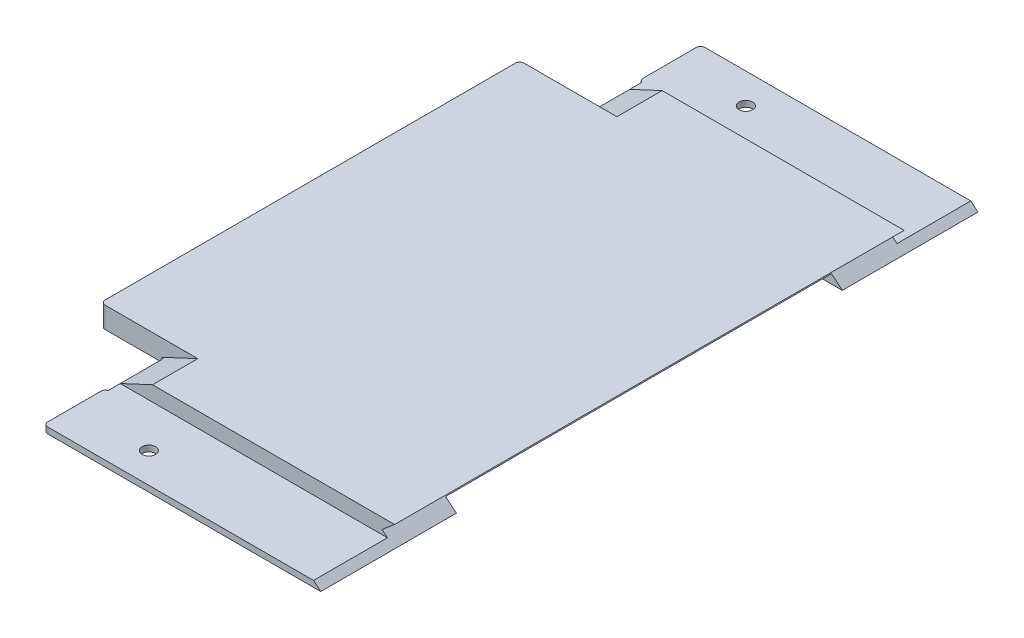
ISO-10303-21;
HEADER;
FILE_DESCRIPTION(('STEP AP214'),'2;1');
FILE_NAME('part.step','',(''),(''),'','','');
FILE_SCHEMA(('AUTOMOTIVE_DESIGN { 1 0 10303 214 1 1 1 1 }'));
ENDSEC;
DATA;
#1=APPLICATION_CONTEXT('core data for automotive mechanical design processes');
#2=APPLICATION_PROTOCOL_DEFINITION('international standard','automotive_design',2000,#1);
#3=PRODUCT_CONTEXT('',#1,'mechanical');
#4=PRODUCT('Part','Part','',(#3));
#5=PRODUCT_RELATED_PRODUCT_CATEGORY('part','',(#4));
#6=PRODUCT_DEFINITION_FORMATION('','',#4);
#7=PRODUCT_DEFINITION_CONTEXT('part definition',#1,'design');
#8=PRODUCT_DEFINITION('design','',#6,#7);
#9=PRODUCT_DEFINITION_SHAPE('','',#8);
#10=(LENGTH_UNIT() NAMED_UNIT(*) SI_UNIT(.MILLI.,.METRE.));
#11=(NAMED_UNIT(*) PLANE_ANGLE_UNIT() SI_UNIT($,.RADIAN.));
#12=(NAMED_UNIT(*) SI_UNIT($,.STERADIAN.) SOLID_ANGLE_UNIT());
#13=UNCERTAINTY_MEASURE_WITH_UNIT(LENGTH_MEASURE(1.E-05),#10,'distance_accuracy_value','');
#14=(GEOMETRIC_REPRESENTATION_CONTEXT(3) GLOBAL_UNCERTAINTY_ASSIGNED_CONTEXT((#13)) GLOBAL_UNIT_ASSIGNED_CONTEXT((#10,
#11,#12)) REPRESENTATION_CONTEXT('',''));
#15=CARTESIAN_POINT('',(0.,0.,0.));
#16=DIRECTION('',(0.,0.,1.));
#17=DIRECTION('',(1.,0.,0.));
#18=AXIS2_PLACEMENT_3D('',#15,#16,#17);
#19=CARTESIAN_POINT('',(0.,0.,0.));
#20=DIRECTION('',(0.,1.,0.));
#21=DIRECTION('',(0.,0.,1.));
#22=AXIS2_PLACEMENT_3D('',#19,#20,#21);
#23=PLANE('',#22);
#24=CARTESIAN_POINT('',(-67.,0.,-99.));
#25=DIRECTION('',(0.,-1.,0.));
#26=DIRECTION('',(0.,0.,-1.));
#27=AXIS2_PLACEMENT_3D('',#24,#25,#26);
#28=CIRCLE('',#27,2.25);
#29=CARTESIAN_POINT('',(-67.,0.,-101.25));
#30=VERTEX_POINT('',#29);
#31=EDGE_CURVE('E412',#30,#30,#28,.T.);
#32=ORIENTED_EDGE('',*,*,#31,.F.);
#33=EDGE_LOOP('',(#32));
#34=FACE_BOUND('',#33,.T.);
#35=DIRECTION('',(-1.,0.,0.));
#36=VECTOR('',#35,1.);
#37=CARTESIAN_POINT('',(0.,0.,-109.));
#38=LINE('',#37,#36);
#39=CARTESIAN_POINT('',(0.,0.,-109.));
#40=VERTEX_POINT('',#39);
#41=CARTESIAN_POINT('',(-90.5,0.,-109.));
#42=VERTEX_POINT('',#41);
#43=EDGE_CURVE('E462',#40,#42,#38,.T.);
#44=ORIENTED_EDGE('',*,*,#43,.F.);
#45=DIRECTION('',(0.,0.,-1.));
#46=VECTOR('',#45,1.);
#47=CARTESIAN_POINT('',(0.,0.,109.));
#48=LINE('',#47,#46);
#49=CARTESIAN_POINT('',(0.,0.,-64.));
#50=VERTEX_POINT('',#49);
#51=EDGE_CURVE('E297',#50,#40,#48,.T.);
#52=ORIENTED_EDGE('',*,*,#51,.F.);
#53=DIRECTION('',(1.,0.,0.));
#54=VECTOR('',#53,1.);
#55=CARTESIAN_POINT('',(0.,0.,-64.));
#56=LINE('',#55,#54);
#57=CARTESIAN_POINT('',(-41.875,0.,-64.));
#58=VERTEX_POINT('',#57);
#59=EDGE_CURVE('E489',#58,#50,#56,.T.);
#60=ORIENTED_EDGE('',*,*,#59,.F.);
#61=CARTESIAN_POINT('',(-41.875,0.,-63.));
#62=DIRECTION('',(0.,1.,0.));
#63=DIRECTION('',(0.,0.,1.));
#64=AXIS2_PLACEMENT_3D('',#61,#62,#63);
#65=CIRCLE('',#64,1.);
#66=CARTESIAN_POINT('',(-42.875,0.,-63.));
#67=VERTEX_POINT('',#66);
#68=EDGE_CURVE('E504',#58,#67,#65,.T.);
#69=ORIENTED_EDGE('',*,*,#68,.T.);
#70=DIRECTION('',(0.,0.,1.));
#71=VECTOR('',#70,1.);
#72=CARTESIAN_POINT('',(-42.875,0.,64.));
#73=LINE('',#72,#71);
#74=CARTESIAN_POINT('',(-42.875,0.,63.));
#75=VERTEX_POINT('',#74);
#76=EDGE_CURVE('E420',#67,#75,#73,.T.);
#77=ORIENTED_EDGE('',*,*,#76,.T.);
#78=CARTESIAN_POINT('',(-41.875,0.,63.));
#79=DIRECTION('',(0.,-1.,0.));
#80=DIRECTION('',(0.,0.,-1.));
#81=AXIS2_PLACEMENT_3D('',#78,#79,#80);
#82=CIRCLE('',#81,1.);
#83=CARTESIAN_POINT('',(-41.875,0.,64.));
#84=VERTEX_POINT('',#83);
#85=EDGE_CURVE('E358',#84,#75,#82,.T.);
#86=ORIENTED_EDGE('',*,*,#85,.F.);
#87=DIRECTION('',(1.,0.,0.));
#88=VECTOR('',#87,1.);
#89=CARTESIAN_POINT('',(0.,0.,64.));
#90=LINE('',#89,#88);
#91=CARTESIAN_POINT('',(0.,0.,64.));
#92=VERTEX_POINT('',#91);
#93=EDGE_CURVE('E309',#84,#92,#90,.T.);
#94=ORIENTED_EDGE('',*,*,#93,.T.);
#95=CARTESIAN_POINT('',(0.,0.,109.));
#96=VERTEX_POINT('',#95);
#97=EDGE_CURVE('E62',#96,#92,#48,.T.);
#98=ORIENTED_EDGE('',*,*,#97,.F.);
#99=DIRECTION('',(-1.,0.,0.));
#100=VECTOR('',#99,1.);
#101=CARTESIAN_POINT('',(0.,0.,109.));
#102=LINE('',#101,#100);
#103=CARTESIAN_POINT('',(-90.5,0.,109.));
#104=VERTEX_POINT('',#103);
#105=EDGE_CURVE('E305',#96,#104,#102,.T.);
#106=ORIENTED_EDGE('',*,*,#105,.T.);
#107=CARTESIAN_POINT('',(-90.5,0.,107.5));
#108=DIRECTION('',(0.,-1.,0.));
#109=DIRECTION('',(0.,0.,-1.));
#110=AXIS2_PLACEMENT_3D('',#107,#108,#109);
#111=CIRCLE('',#110,1.5);
#112=CARTESIAN_POINT('',(-92.,0.,107.5));
#113=VERTEX_POINT('',#112);
#114=EDGE_CURVE('E374',#113,#104,#111,.F.);
#115=ORIENTED_EDGE('',*,*,#114,.F.);
#116=DIRECTION('',(0.,0.,1.));
#117=VECTOR('',#116,1.);
#118=CARTESIAN_POINT('',(-92.,0.,109.));
#119=LINE('',#118,#117);
#120=CARTESIAN_POINT('',(-92.,0.,89.9142135623731));
#121=VERTEX_POINT('',#120);
#122=EDGE_CURVE('E319',#121,#113,#119,.T.);
#123=ORIENTED_EDGE('',*,*,#122,.F.);
#124=CARTESIAN_POINT('',(-90.5,0.,89.9142135623731));
#125=DIRECTION('',(0.,-1.,0.));
#126=DIRECTION('',(0.,0.,-1.));
#127=AXIS2_PLACEMENT_3D('',#124,#125,#126);
#128=CIRCLE('',#127,1.5);
#129=CARTESIAN_POINT('',(-91.,0.,88.5));
#130=VERTEX_POINT('',#129);
#131=EDGE_CURVE('E381',#130,#121,#128,.F.);
#132=ORIENTED_EDGE('',*,*,#131,.F.);
#133=DIRECTION('',(0.,0.,1.));
#134=VECTOR('',#133,1.);
#135=CARTESIAN_POINT('',(-91.,0.,88.5));
#136=LINE('',#135,#134);
#137=CARTESIAN_POINT('',(-91.,0.,71.));
#138=VERTEX_POINT('',#137);
#139=EDGE_CURVE('E588',#138,#130,#136,.T.);
#140=ORIENTED_EDGE('',*,*,#139,.F.);
#141=CARTESIAN_POINT('',(-92.5,0.,71.));
#142=DIRECTION('',(0.,-1.,0.));
#143=DIRECTION('',(0.,0.,-1.));
#144=AXIS2_PLACEMENT_3D('',#141,#142,#143);
#145=CIRCLE('',#144,1.5);
#146=CARTESIAN_POINT('',(-92.5,0.,69.5));
#147=VERTEX_POINT('',#146);
#148=EDGE_CURVE('E408',#147,#138,#145,.T.);
#149=ORIENTED_EDGE('',*,*,#148,.F.);
#150=DIRECTION('',(1.,0.,0.));
#151=VECTOR('',#150,1.);
#152=CARTESIAN_POINT('',(-112.5,0.,69.5));
#153=LINE('',#152,#151);
#154=CARTESIAN_POINT('',(-111.,0.,69.5));
#155=VERTEX_POINT('',#154);
#156=EDGE_CURVE('E584',#155,#147,#153,.T.);
#157=ORIENTED_EDGE('',*,*,#156,.F.);
#158=CARTESIAN_POINT('',(-111.,0.,68.));
#159=DIRECTION('',(0.,-1.,0.));
#160=DIRECTION('',(0.,0.,-1.));
#161=AXIS2_PLACEMENT_3D('',#158,#159,#160);
#162=CIRCLE('',#161,1.5);
#163=CARTESIAN_POINT('',(-112.5,0.,68.));
#164=VERTEX_POINT('',#163);
#165=EDGE_CURVE('E377',#164,#155,#162,.F.);
#166=ORIENTED_EDGE('',*,*,#165,.F.);
#167=DIRECTION('',(0.,0.,1.));
#168=VECTOR('',#167,1.);
#169=CARTESIAN_POINT('',(-112.5,0.,0.));
#170=LINE('',#169,#168);
#171=CARTESIAN_POINT('',(-112.5,0.,-68.));
#172=VERTEX_POINT('',#171);
#173=EDGE_CURVE('E470',#172,#164,#170,.T.);
#174=ORIENTED_EDGE('',*,*,#173,.F.);
#175=CARTESIAN_POINT('',(-111.,0.,-68.));
#176=DIRECTION('',(0.,1.,0.));
#177=DIRECTION('',(0.,0.,1.));
#178=AXIS2_PLACEMENT_3D('',#175,#176,#177);
#179=CIRCLE('',#178,1.5);
#180=CARTESIAN_POINT('',(-111.,0.,-69.5));
#181=VERTEX_POINT('',#180);
#182=EDGE_CURVE('E524',#172,#181,#179,.F.);
#183=ORIENTED_EDGE('',*,*,#182,.T.);
#184=DIRECTION('',(1.,0.,0.));
#185=VECTOR('',#184,1.);
#186=CARTESIAN_POINT('',(-112.5,0.,-69.5));
#187=LINE('',#186,#185);
#188=CARTESIAN_POINT('',(-92.5,0.,-69.5));
#189=VERTEX_POINT('',#188);
#190=EDGE_CURVE('E437',#181,#189,#187,.T.);
#191=ORIENTED_EDGE('',*,*,#190,.T.);
#192=CARTESIAN_POINT('',(-92.5,0.,-71.));
#193=DIRECTION('',(0.,1.,0.));
#194=DIRECTION('',(0.,0.,1.));
#195=AXIS2_PLACEMENT_3D('',#192,#193,#194);
#196=CIRCLE('',#195,1.5);
#197=CARTESIAN_POINT('',(-91.,0.,-71.));
#198=VERTEX_POINT('',#197);
#199=EDGE_CURVE('E552',#189,#198,#196,.T.);
#200=ORIENTED_EDGE('',*,*,#199,.T.);
#201=DIRECTION('',(0.,0.,-1.));
#202=VECTOR('',#201,1.);
#203=CARTESIAN_POINT('',(-91.,0.,-88.5));
#204=LINE('',#203,#202);
#205=CARTESIAN_POINT('',(-91.,0.,-88.5));
#206=VERTEX_POINT('',#205);
#207=EDGE_CURVE('E441',#198,#206,#204,.T.);
#208=ORIENTED_EDGE('',*,*,#207,.T.);
#209=CARTESIAN_POINT('',(-90.5,0.,-89.9142135623731));
#210=DIRECTION('',(0.,1.,0.));
#211=DIRECTION('',(0.,0.,1.));
#212=AXIS2_PLACEMENT_3D('',#209,#210,#211);
#213=CIRCLE('',#212,1.5);
#214=CARTESIAN_POINT('',(-92.,0.,-89.9142135623731));
#215=VERTEX_POINT('',#214);
#216=EDGE_CURVE('E527',#206,#215,#213,.F.);
#217=ORIENTED_EDGE('',*,*,#216,.T.);
#218=DIRECTION('',(0.,0.,-1.));
#219=VECTOR('',#218,1.);
#220=CARTESIAN_POINT('',(-92.,0.,-109.));
#221=LINE('',#220,#219);
#222=CARTESIAN_POINT('',(-92.,0.,-107.5));
#223=VERTEX_POINT('',#222);
#224=EDGE_CURVE('E458',#215,#223,#221,.T.);
#225=ORIENTED_EDGE('',*,*,#224,.T.);
#226=CARTESIAN_POINT('',(-90.5,0.,-107.5));
#227=DIRECTION('',(0.,1.,0.));
#228=DIRECTION('',(0.,0.,1.));
#229=AXIS2_PLACEMENT_3D('',#226,#227,#228);
#230=CIRCLE('',#229,1.5);
#231=EDGE_CURVE('E520',#223,#42,#230,.F.);
#232=ORIENTED_EDGE('',*,*,#231,.T.);
#233=EDGE_LOOP('',(#44,#52,#60,#69,#77,#86,#94,#98,#106,#115,#123,#132,#140,#149,#157,#166,#174,
#183,#191,#200,#208,#217,#225,#232));
#234=FACE_BOUND('',#233,.T.);
#235=CARTESIAN_POINT('',(-67.,0.,99.));
#236=DIRECTION('',(0.,1.,0.));
#237=DIRECTION('',(0.,0.,1.));
#238=AXIS2_PLACEMENT_3D('',#235,#236,#237);
#239=CIRCLE('',#238,2.25);
#240=CARTESIAN_POINT('',(-67.,0.,101.25));
#241=VERTEX_POINT('',#240);
#242=EDGE_CURVE('E580',#241,#241,#239,.T.);
#243=ORIENTED_EDGE('',*,*,#242,.T.);
#244=EDGE_LOOP('',(#243));
#245=FACE_BOUND('',#244,.T.);
#246=ADVANCED_FACE('F43',(#34,#234,#245),#23,.F.);
#247=CARTESIAN_POINT('',(-91.,7.,0.));
#248=DIRECTION('',(1.,0.,0.));
#249=DIRECTION('',(0.,0.,-1.));
#250=AXIS2_PLACEMENT_3D('',#247,#248,#249);
#251=PLANE('',#250);
#252=ORIENTED_EDGE('',*,*,#207,.F.);
#253=DIRECTION('',(0.,1.,0.));
#254=VECTOR('',#253,1.);
#255=CARTESIAN_POINT('',(-91.,2.,-71.));
#256=LINE('',#255,#254);
#257=CARTESIAN_POINT('',(-91.,2.,-71.));
#258=VERTEX_POINT('',#257);
#259=EDGE_CURVE('E547',#198,#258,#256,.T.);
#260=ORIENTED_EDGE('',*,*,#259,.T.);
#261=DIRECTION('',(0.,0.,-1.));
#262=VECTOR('',#261,1.);
#263=CARTESIAN_POINT('',(-91.,2.,-84.5));
#264=LINE('',#263,#262);
#265=CARTESIAN_POINT('',(-91.,2.,-84.5));
#266=VERTEX_POINT('',#265);
#267=EDGE_CURVE('E478',#258,#266,#264,.T.);
#268=ORIENTED_EDGE('',*,*,#267,.T.);
#269=DIRECTION('',(0.,0.,-1.));
#270=VECTOR('',#269,1.);
#271=CARTESIAN_POINT('',(-91.,2.,-88.5));
#272=LINE('',#271,#270);
#273=CARTESIAN_POINT('',(-91.,2.,-88.5));
#274=VERTEX_POINT('',#273);
#275=EDGE_CURVE('E433',#266,#274,#272,.T.);
#276=ORIENTED_EDGE('',*,*,#275,.T.);
#277=DIRECTION('',(0.,1.,0.));
#278=VECTOR('',#277,1.);
#279=CARTESIAN_POINT('',(-91.,0.,-88.5));
#280=LINE('',#279,#278);
#281=EDGE_CURVE('E444',#206,#274,#280,.T.);
#282=ORIENTED_EDGE('',*,*,#281,.F.);
#283=EDGE_LOOP('',(#252,#260,#268,#276,#282));
#284=FACE_BOUND('',#283,.T.);
#285=ADVANCED_FACE('F662',(#284),#251,.F.);
#286=CARTESIAN_POINT('',(0.,2.,0.));
#287=DIRECTION('',(0.,1.,0.));
#288=DIRECTION('',(0.,0.,1.));
#289=AXIS2_PLACEMENT_3D('',#286,#287,#288);
#290=PLANE('',#289);
#291=DIRECTION('',(0.,0.,1.));
#292=VECTOR('',#291,1.);
#293=CARTESIAN_POINT('',(-2.38350718518845,2.,0.));
#294=LINE('',#293,#292);
#295=CARTESIAN_POINT('',(-2.38350718518846,2.,-109.));
#296=VERTEX_POINT('',#295);
#297=CARTESIAN_POINT('',(-2.38350718518846,2.,-84.5));
#298=VERTEX_POINT('',#297);
#299=EDGE_CURVE('E708',#296,#298,#294,.T.);
#300=ORIENTED_EDGE('',*,*,#299,.F.);
#301=DIRECTION('',(-1.,0.,0.));
#302=VECTOR('',#301,1.);
#303=CARTESIAN_POINT('',(0.,2.,-109.));
#304=LINE('',#303,#302);
#305=CARTESIAN_POINT('',(-90.5,2.,-109.));
#306=VERTEX_POINT('',#305);
#307=EDGE_CURVE('E466',#296,#306,#304,.T.);
#308=ORIENTED_EDGE('',*,*,#307,.T.);
#309=CARTESIAN_POINT('',(-90.5,2.,-107.5));
#310=DIRECTION('',(0.,1.,0.));
#311=DIRECTION('',(0.,0.,1.));
#312=AXIS2_PLACEMENT_3D('',#309,#310,#311);
#313=CIRCLE('',#312,1.5);
#314=CARTESIAN_POINT('',(-92.,2.,-107.5));
#315=VERTEX_POINT('',#314);
#316=EDGE_CURVE('E514',#306,#315,#313,.T.);
#317=ORIENTED_EDGE('',*,*,#316,.T.);
#318=DIRECTION('',(0.,0.,-1.));
#319=VECTOR('',#318,1.);
#320=CARTESIAN_POINT('',(-92.,2.,-109.));
#321=LINE('',#320,#319);
#322=CARTESIAN_POINT('',(-92.,2.,-89.9142135623731));
#323=VERTEX_POINT('',#322);
#324=EDGE_CURVE('E455',#323,#315,#321,.T.);
#325=ORIENTED_EDGE('',*,*,#324,.F.);
#326=CARTESIAN_POINT('',(-90.5,2.,-89.9142135623731));
#327=DIRECTION('',(0.,1.,0.));
#328=DIRECTION('',(0.,0.,1.));
#329=AXIS2_PLACEMENT_3D('',#326,#327,#328);
#330=CIRCLE('',#329,1.5);
#331=EDGE_CURVE('E517',#323,#274,#330,.T.);
#332=ORIENTED_EDGE('',*,*,#331,.T.);
#333=ORIENTED_EDGE('',*,*,#275,.F.);
#334=DIRECTION('',(-1.,0.,0.));
#335=VECTOR('',#334,1.);
#336=CARTESIAN_POINT('',(0.,2.,-84.5));
#337=LINE('',#336,#335);
#338=EDGE_CURVE('E451',#298,#266,#337,.T.);
#339=ORIENTED_EDGE('',*,*,#338,.F.);
#340=EDGE_LOOP('',(#300,#308,#317,#325,#332,#333,#339));
#341=FACE_BOUND('',#340,.T.);
#342=CARTESIAN_POINT('',(-67.,2.,-99.));
#343=DIRECTION('',(0.,1.,0.));
#344=DIRECTION('',(0.,0.,1.));
#345=AXIS2_PLACEMENT_3D('',#342,#343,#344);
#346=CIRCLE('',#345,2.25);
#347=CARTESIAN_POINT('',(-67.,2.,-96.75));
#348=VERTEX_POINT('',#347);
#349=EDGE_CURVE('E416',#348,#348,#346,.T.);
#350=ORIENTED_EDGE('',*,*,#349,.F.);
#351=EDGE_LOOP('',(#350));
#352=FACE_BOUND('',#351,.T.);
#353=ADVANCED_FACE('F677',(#341,#352),#290,.T.);
#354=CARTESIAN_POINT('',(0.,2.,-109.));
#355=DIRECTION('',(0.,0.,1.));
#356=DIRECTION('',(1.,0.,0.));
#357=AXIS2_PLACEMENT_3D('',#354,#355,#356);
#358=PLANE('',#357);
#359=ORIENTED_EDGE('',*,*,#307,.F.);
#360=DIRECTION('',(-0.766044443118982,0.642787609686535,0.));
#361=VECTOR('',#360,1.);
#362=CARTESIAN_POINT('',(0.,0.,-109.));
#363=LINE('',#362,#361);
#364=EDGE_CURVE('E298',#40,#296,#363,.T.);
#365=ORIENTED_EDGE('',*,*,#364,.F.);
#366=ORIENTED_EDGE('',*,*,#43,.T.);
#367=DIRECTION('',(0.,1.,0.));
#368=VECTOR('',#367,1.);
#369=CARTESIAN_POINT('',(-90.5,2.,-109.));
#370=LINE('',#369,#368);
#371=EDGE_CURVE('E543',#42,#306,#370,.T.);
#372=ORIENTED_EDGE('',*,*,#371,.T.);
#373=EDGE_LOOP('',(#359,#365,#366,#372));
#374=FACE_BOUND('',#373,.T.);
#375=ADVANCED_FACE('F689',(#374),#358,.F.);
#376=CARTESIAN_POINT('',(-112.5,2.,0.));
#377=DIRECTION('',(1.,0.,0.));
#378=DIRECTION('',(0.,0.,-1.));
#379=AXIS2_PLACEMENT_3D('',#376,#377,#378);
#380=PLANE('',#379);
#381=DIRECTION('',(0.,0.,1.));
#382=VECTOR('',#381,1.);
#383=CARTESIAN_POINT('',(-112.5,7.00000000000001,-69.5));
#384=LINE('',#383,#382);
#385=CARTESIAN_POINT('',(-112.5,7.00000000000001,-68.));
#386=VERTEX_POINT('',#385);
#387=CARTESIAN_POINT('',(-112.5,7.00000000000001,68.));
#388=VERTEX_POINT('',#387);
#389=EDGE_CURVE('E430',#386,#388,#384,.T.);
#390=ORIENTED_EDGE('',*,*,#389,.F.);
#391=DIRECTION('',(0.,1.,0.));
#392=VECTOR('',#391,1.);
#393=CARTESIAN_POINT('',(-112.5,2.,-68.));
#394=LINE('',#393,#392);
#395=EDGE_CURVE('E540',#386,#172,#394,.F.);
#396=ORIENTED_EDGE('',*,*,#395,.T.);
#397=ORIENTED_EDGE('',*,*,#173,.T.);
#398=DIRECTION('',(0.,1.,0.));
#399=VECTOR('',#398,1.);
#400=CARTESIAN_POINT('',(-112.5,2.,68.));
#401=LINE('',#400,#399);
#402=EDGE_CURVE('E395',#388,#164,#401,.F.);
#403=ORIENTED_EDGE('',*,*,#402,.F.);
#404=EDGE_LOOP('',(#390,#396,#397,#403));
#405=FACE_BOUND('',#404,.T.);
#406=ADVANCED_FACE('F640',(#405),#380,.F.);
#407=CARTESIAN_POINT('',(-92.,0.,-109.));
#408=DIRECTION('',(1.,0.,0.));
#409=DIRECTION('',(0.,0.,-1.));
#410=AXIS2_PLACEMENT_3D('',#407,#408,#409);
#411=PLANE('',#410);
#412=ORIENTED_EDGE('',*,*,#224,.F.);
#413=DIRECTION('',(0.,-1.,0.));
#414=VECTOR('',#413,1.);
#415=CARTESIAN_POINT('',(-92.,0.,-89.9142135623731));
#416=LINE('',#415,#414);
#417=EDGE_CURVE('E510',#215,#323,#416,.F.);
#418=ORIENTED_EDGE('',*,*,#417,.T.);
#419=ORIENTED_EDGE('',*,*,#324,.T.);
#420=DIRECTION('',(0.,1.,0.));
#421=VECTOR('',#420,1.);
#422=CARTESIAN_POINT('',(-92.,0.,-107.5));
#423=LINE('',#422,#421);
#424=EDGE_CURVE('E507',#315,#223,#423,.F.);
#425=ORIENTED_EDGE('',*,*,#424,.T.);
#426=EDGE_LOOP('',(#412,#418,#419,#425));
#427=FACE_BOUND('',#426,.T.);
#428=ADVANCED_FACE('F671',(#427),#411,.F.);
#429=CARTESIAN_POINT('',(0.,7.,-84.5));
#430=DIRECTION('',(0.,0.,1.));
#431=DIRECTION('',(1.,0.,0.));
#432=AXIS2_PLACEMENT_3D('',#429,#430,#431);
#433=PLANE('',#432);
#434=DIRECTION('',(-1.,0.,0.));
#435=VECTOR('',#434,1.);
#436=CARTESIAN_POINT('',(0.,7.,-84.5));
#437=LINE('',#436,#435);
#438=CARTESIAN_POINT('',(0.,7.,-84.4999999999999));
#439=VERTEX_POINT('',#438);
#440=CARTESIAN_POINT('',(-80.2774653974522,7.,-84.5));
#441=VERTEX_POINT('',#440);
#442=EDGE_CURVE('E452',#439,#441,#437,.T.);
#443=ORIENTED_EDGE('',*,*,#442,.F.);
#444=DIRECTION('',(-0.766044443118984,-0.642787609686533,0.));
#445=VECTOR('',#444,1.);
#446=CARTESIAN_POINT('',(0.,7.,-84.5));
#447=LINE('',#446,#445);
#448=CARTESIAN_POINT('',(-4.1711375740798,3.5,-84.4999999999999));
#449=VERTEX_POINT('',#448);
#450=EDGE_CURVE('E710',#439,#449,#447,.T.);
#451=ORIENTED_EDGE('',*,*,#450,.T.);
#452=DIRECTION('',(0.766044443118982,-0.642787609686535,0.));
#453=VECTOR('',#452,1.);
#454=CARTESIAN_POINT('',(-3.44682713554273,2.8922313781657,-84.5));
#455=LINE('',#454,#453);
#456=EDGE_CURVE('E705',#449,#298,#455,.T.);
#457=ORIENTED_EDGE('',*,*,#456,.T.);
#458=ORIENTED_EDGE('',*,*,#338,.T.);
#459=DIRECTION('',(0.90630778703665,0.4226182617407,0.));
#460=VECTOR('',#459,1.);
#461=CARTESIAN_POINT('',(-80.2774653974522,6.99999999999999,-84.5));
#462=LINE('',#461,#460);
#463=EDGE_CURVE('E482',#266,#441,#462,.T.);
#464=ORIENTED_EDGE('',*,*,#463,.T.);
#465=EDGE_LOOP('',(#443,#451,#457,#458,#464));
#466=FACE_BOUND('',#465,.T.);
#467=ADVANCED_FACE('F809',(#466),#433,.F.);
#468=CARTESIAN_POINT('',(0.,7.,0.));
#469=DIRECTION('',(0.,1.,0.));
#470=DIRECTION('',(0.,0.,1.));
#471=AXIS2_PLACEMENT_3D('',#468,#469,#470);
#472=PLANE('',#471);
#473=DIRECTION('',(0.,0.,-1.));
#474=VECTOR('',#473,1.);
#475=CARTESIAN_POINT('',(0.,7.,109.));
#476=LINE('',#475,#474);
#477=CARTESIAN_POINT('',(0.,7.,84.5));
#478=VERTEX_POINT('',#477);
#479=EDGE_CURVE('E569',#478,#439,#476,.T.);
#480=ORIENTED_EDGE('',*,*,#479,.T.);
#481=ORIENTED_EDGE('',*,*,#442,.T.);
#482=DIRECTION('',(0.,0.,1.));
#483=VECTOR('',#482,1.);
#484=CARTESIAN_POINT('',(-80.2774653974522,7.,-69.5));
#485=LINE('',#484,#483);
#486=CARTESIAN_POINT('',(-80.2774653974522,7.00000000000001,-69.5));
#487=VERTEX_POINT('',#486);
#488=EDGE_CURVE('E469',#441,#487,#485,.T.);
#489=ORIENTED_EDGE('',*,*,#488,.T.);
#490=DIRECTION('',(-1.,0.,0.));
#491=VECTOR('',#490,1.);
#492=CARTESIAN_POINT('',(-91.,7.00000000000001,-69.5));
#493=LINE('',#492,#491);
#494=CARTESIAN_POINT('',(-111.,7.00000000000001,-69.5));
#495=VERTEX_POINT('',#494);
#496=EDGE_CURVE('E427',#487,#495,#493,.T.);
#497=ORIENTED_EDGE('',*,*,#496,.T.);
#498=CARTESIAN_POINT('',(-111.,7.,-68.));
#499=DIRECTION('',(0.,1.,0.));
#500=DIRECTION('',(0.,0.,1.));
#501=AXIS2_PLACEMENT_3D('',#498,#499,#500);
#502=CIRCLE('',#501,1.5);
#503=EDGE_CURVE('E537',#495,#386,#502,.T.);
#504=ORIENTED_EDGE('',*,*,#503,.T.);
#505=ORIENTED_EDGE('',*,*,#389,.T.);
#506=CARTESIAN_POINT('',(-111.,7.,68.));
#507=DIRECTION('',(0.,-1.,0.));
#508=DIRECTION('',(0.,0.,-1.));
#509=AXIS2_PLACEMENT_3D('',#506,#507,#508);
#510=CIRCLE('',#509,1.5);
#511=CARTESIAN_POINT('',(-111.,7.00000000000001,69.5));
#512=VERTEX_POINT('',#511);
#513=EDGE_CURVE('E391',#512,#388,#510,.T.);
#514=ORIENTED_EDGE('',*,*,#513,.F.);
#515=DIRECTION('',(-1.,0.,0.));
#516=VECTOR('',#515,1.);
#517=CARTESIAN_POINT('',(-91.,7.00000000000001,69.5));
#518=LINE('',#517,#516);
#519=CARTESIAN_POINT('',(-80.2774653974522,7.00000000000001,69.5));
#520=VERTEX_POINT('',#519);
#521=EDGE_CURVE('E572',#520,#512,#518,.T.);
#522=ORIENTED_EDGE('',*,*,#521,.F.);
#523=DIRECTION('',(0.,0.,-1.));
#524=VECTOR('',#523,1.);
#525=CARTESIAN_POINT('',(-80.2774653974522,7.,69.5));
#526=LINE('',#525,#524);
#527=CARTESIAN_POINT('',(-80.2774653974522,7.,84.5));
#528=VERTEX_POINT('',#527);
#529=EDGE_CURVE('E323',#528,#520,#526,.T.);
#530=ORIENTED_EDGE('',*,*,#529,.F.);
#531=DIRECTION('',(-1.,0.,0.));
#532=VECTOR('',#531,1.);
#533=CARTESIAN_POINT('',(0.,7.,84.5));
#534=LINE('',#533,#532);
#535=EDGE_CURVE('E600',#478,#528,#534,.T.);
#536=ORIENTED_EDGE('',*,*,#535,.F.);
#537=EDGE_LOOP('',(#480,#481,#489,#497,#504,#505,#514,#522,#530,#536));
#538=FACE_BOUND('',#537,.T.);
#539=ADVANCED_FACE('F652',(#538),#472,.T.);
#540=CARTESIAN_POINT('',(-112.5,0.,-69.5));
#541=DIRECTION('',(0.,0.,1.));
#542=DIRECTION('',(1.,0.,0.));
#543=AXIS2_PLACEMENT_3D('',#540,#541,#542);
#544=PLANE('',#543);
#545=ORIENTED_EDGE('',*,*,#190,.F.);
#546=DIRECTION('',(0.,1.,0.));
#547=VECTOR('',#546,1.);
#548=CARTESIAN_POINT('',(-111.,0.,-69.5));
#549=LINE('',#548,#547);
#550=EDGE_CURVE('E533',#181,#495,#549,.T.);
#551=ORIENTED_EDGE('',*,*,#550,.T.);
#552=ORIENTED_EDGE('',*,*,#496,.F.);
#553=DIRECTION('',(-0.90630778703665,-0.4226182617407,0.));
#554=VECTOR('',#553,1.);
#555=CARTESIAN_POINT('',(-109.426011247249,-6.59219015384248,-69.5));
#556=LINE('',#555,#554);
#557=CARTESIAN_POINT('',(-92.5,1.30053851276749,-69.5));
#558=VERTEX_POINT('',#557);
#559=EDGE_CURVE('E486',#487,#558,#556,.T.);
#560=ORIENTED_EDGE('',*,*,#559,.T.);
#561=DIRECTION('',(0.,1.,0.));
#562=VECTOR('',#561,1.);
#563=CARTESIAN_POINT('',(-92.5,0.,-69.5));
#564=LINE('',#563,#562);
#565=EDGE_CURVE('E530',#558,#189,#564,.F.);
#566=ORIENTED_EDGE('',*,*,#565,.T.);
#567=EDGE_LOOP('',(#545,#551,#552,#560,#566));
#568=FACE_BOUND('',#567,.T.);
#569=ADVANCED_FACE('F648',(#568),#544,.F.);
#570=CARTESIAN_POINT('',(-80.2774653974522,7.,0.));
#571=DIRECTION('',(-0.4226182617407,0.90630778703665,0.));
#572=DIRECTION('',(0.,0.,-1.));
#573=AXIS2_PLACEMENT_3D('',#570,#571,#572);
#574=PLANE('',#573);
#575=ORIENTED_EDGE('',*,*,#463,.F.);
#576=ORIENTED_EDGE('',*,*,#267,.F.);
#577=CARTESIAN_POINT('',(-92.5,1.3005385127675,-71.));
#578=DIRECTION('',(-0.4226182617407,0.90630778703665,0.));
#579=DIRECTION('',(-0.90630778703665,-0.4226182617407,0.));
#580=AXIS2_PLACEMENT_3D('',#577,#578,#579);
#581=ELLIPSE('',#580,1.65506687844374,1.5);
#582=EDGE_CURVE('E73',#258,#558,#581,.F.);
#583=ORIENTED_EDGE('',*,*,#582,.T.);
#584=ORIENTED_EDGE('',*,*,#559,.F.);
#585=ORIENTED_EDGE('',*,*,#488,.F.);
#586=EDGE_LOOP('',(#575,#576,#583,#584,#585));
#587=FACE_BOUND('',#586,.T.);
#588=ADVANCED_FACE('F657',(#587),#574,.T.);
#589=CARTESIAN_POINT('',(0.,3.,0.));
#590=DIRECTION('',(0.,1.,0.));
#591=DIRECTION('',(0.,0.,1.));
#592=AXIS2_PLACEMENT_3D('',#589,#590,#591);
#593=PLANE('',#592);
#594=DIRECTION('',(-1.,0.,0.));
#595=VECTOR('',#594,1.);
#596=CARTESIAN_POINT('',(42.875,3.,-64.));
#597=LINE('',#596,#595);
#598=CARTESIAN_POINT('',(-3.57526077778268,3.,-64.));
#599=VERTEX_POINT('',#598);
#600=CARTESIAN_POINT('',(-41.875,3.,-64.));
#601=VERTEX_POINT('',#600);
#602=EDGE_CURVE('E424',#599,#601,#597,.T.);
#603=ORIENTED_EDGE('',*,*,#602,.F.);
#604=DIRECTION('',(0.,0.,1.));
#605=VECTOR('',#604,1.);
#606=CARTESIAN_POINT('',(-3.57526077778267,3.,0.));
#607=LINE('',#606,#605);
#608=CARTESIAN_POINT('',(-3.57526077778267,3.,64.));
#609=VERTEX_POINT('',#608);
#610=EDGE_CURVE('E557',#599,#609,#607,.T.);
#611=ORIENTED_EDGE('',*,*,#610,.T.);
#612=DIRECTION('',(-1.,0.,0.));
#613=VECTOR('',#612,1.);
#614=CARTESIAN_POINT('',(42.875,3.,64.));
#615=LINE('',#614,#613);
#616=CARTESIAN_POINT('',(-41.875,3.,64.));
#617=VERTEX_POINT('',#616);
#618=EDGE_CURVE('E565',#609,#617,#615,.T.);
#619=ORIENTED_EDGE('',*,*,#618,.T.);
#620=CARTESIAN_POINT('',(-41.875,3.,63.));
#621=DIRECTION('',(0.,-1.,0.));
#622=DIRECTION('',(0.,0.,-1.));
#623=AXIS2_PLACEMENT_3D('',#620,#621,#622);
#624=CIRCLE('',#623,1.);
#625=CARTESIAN_POINT('',(-42.875,3.,63.));
#626=VERTEX_POINT('',#625);
#627=EDGE_CURVE('E354',#626,#617,#624,.F.);
#628=ORIENTED_EDGE('',*,*,#627,.F.);
#629=DIRECTION('',(0.,0.,1.));
#630=VECTOR('',#629,1.);
#631=CARTESIAN_POINT('',(-42.875,3.,64.));
#632=LINE('',#631,#630);
#633=CARTESIAN_POINT('',(-42.875,3.,-63.));
#634=VERTEX_POINT('',#633);
#635=EDGE_CURVE('E421',#634,#626,#632,.T.);
#636=ORIENTED_EDGE('',*,*,#635,.F.);
#637=CARTESIAN_POINT('',(-41.875,3.,-63.));
#638=DIRECTION('',(0.,1.,0.));
#639=DIRECTION('',(0.,0.,1.));
#640=AXIS2_PLACEMENT_3D('',#637,#638,#639);
#641=CIRCLE('',#640,1.);
#642=EDGE_CURVE('E500',#634,#601,#641,.F.);
#643=ORIENTED_EDGE('',*,*,#642,.T.);
#644=EDGE_LOOP('',(#603,#611,#619,#628,#636,#643));
#645=FACE_BOUND('',#644,.T.);
#646=ADVANCED_FACE('F563',(#645),#593,.F.);
#647=CARTESIAN_POINT('',(-42.875,3.,64.));
#648=DIRECTION('',(1.,0.,0.));
#649=DIRECTION('',(0.,0.,-1.));
#650=AXIS2_PLACEMENT_3D('',#647,#648,#649);
#651=PLANE('',#650);
#652=ORIENTED_EDGE('',*,*,#76,.F.);
#653=DIRECTION('',(0.,-1.,0.));
#654=VECTOR('',#653,1.);
#655=CARTESIAN_POINT('',(-42.875,3.,-63.));
#656=LINE('',#655,#654);
#657=EDGE_CURVE('E497',#67,#634,#656,.F.);
#658=ORIENTED_EDGE('',*,*,#657,.T.);
#659=ORIENTED_EDGE('',*,*,#635,.T.);
#660=DIRECTION('',(0.,-1.,0.));
#661=VECTOR('',#660,1.);
#662=CARTESIAN_POINT('',(-42.875,3.,63.));
#663=LINE('',#662,#661);
#664=EDGE_CURVE('E351',#75,#626,#663,.F.);
#665=ORIENTED_EDGE('',*,*,#664,.F.);
#666=EDGE_LOOP('',(#652,#658,#659,#665));
#667=FACE_BOUND('',#666,.T.);
#668=ADVANCED_FACE('F799',(#667),#651,.T.);
#669=CARTESIAN_POINT('',(42.875,3.,-64.));
#670=DIRECTION('',(0.,0.,1.));
#671=DIRECTION('',(1.,0.,0.));
#672=AXIS2_PLACEMENT_3D('',#669,#670,#671);
#673=PLANE('',#672);
#674=DIRECTION('',(0.766044443118982,-0.642787609686535,0.));
#675=VECTOR('',#674,1.);
#676=CARTESIAN_POINT('',(23.6828711792168,-19.8722884716996,-64.));
#677=LINE('',#676,#675);
#678=EDGE_CURVE('E568',#599,#50,#677,.T.);
#679=ORIENTED_EDGE('',*,*,#678,.F.);
#680=ORIENTED_EDGE('',*,*,#602,.T.);
#681=DIRECTION('',(0.,-1.,0.));
#682=VECTOR('',#681,1.);
#683=CARTESIAN_POINT('',(-41.875,0.,-64.));
#684=LINE('',#683,#682);
#685=EDGE_CURVE('E493',#601,#58,#684,.T.);
#686=ORIENTED_EDGE('',*,*,#685,.T.);
#687=ORIENTED_EDGE('',*,*,#59,.T.);
#688=EDGE_LOOP('',(#679,#680,#686,#687));
#689=FACE_BOUND('',#688,.T.);
#690=ADVANCED_FACE('F756',(#689),#673,.T.);
#691=CARTESIAN_POINT('',(-41.875,3.,-63.));
#692=DIRECTION('',(0.,1.,0.));
#693=DIRECTION('',(0.,0.,1.));
#694=AXIS2_PLACEMENT_3D('',#691,#692,#693);
#695=CYLINDRICAL_SURFACE('',#694,1.);
#696=ORIENTED_EDGE('',*,*,#642,.F.);
#697=ORIENTED_EDGE('',*,*,#657,.F.);
#698=ORIENTED_EDGE('',*,*,#68,.F.);
#699=ORIENTED_EDGE('',*,*,#685,.F.);
#700=EDGE_LOOP('',(#696,#697,#698,#699));
#701=FACE_BOUND('',#700,.T.);
#702=ADVANCED_FACE('F752',(#701),#695,.F.);
#703=CARTESIAN_POINT('',(-67.,0.,-99.));
#704=DIRECTION('',(0.,-1.,0.));
#705=DIRECTION('',(0.,0.,-1.));
#706=AXIS2_PLACEMENT_3D('',#703,#704,#705);
#707=CYLINDRICAL_SURFACE('',#706,2.25);
#708=ORIENTED_EDGE('',*,*,#349,.T.);
#709=EDGE_LOOP('',(#708));
#710=FACE_BOUND('',#709,.T.);
#711=ORIENTED_EDGE('',*,*,#31,.T.);
#712=EDGE_LOOP('',(#711));
#713=FACE_BOUND('',#712,.T.);
#714=ADVANCED_FACE('F755',(#710,#713),#707,.F.);
#715=CARTESIAN_POINT('',(-90.5,0.,-89.9142135623731));
#716=DIRECTION('',(0.,-1.,0.));
#717=DIRECTION('',(0.,0.,-1.));
#718=AXIS2_PLACEMENT_3D('',#715,#716,#717);
#719=CYLINDRICAL_SURFACE('',#718,1.5);
#720=ORIENTED_EDGE('',*,*,#216,.F.);
#721=ORIENTED_EDGE('',*,*,#281,.T.);
#722=ORIENTED_EDGE('',*,*,#331,.F.);
#723=ORIENTED_EDGE('',*,*,#417,.F.);
#724=EDGE_LOOP('',(#720,#721,#722,#723));
#725=FACE_BOUND('',#724,.T.);
#726=ADVANCED_FACE('F674',(#725),#719,.T.);
#727=CARTESIAN_POINT('',(-111.,0.,-68.));
#728=DIRECTION('',(0.,1.,0.));
#729=DIRECTION('',(0.,0.,1.));
#730=AXIS2_PLACEMENT_3D('',#727,#728,#729);
#731=CYLINDRICAL_SURFACE('',#730,1.5);
#732=ORIENTED_EDGE('',*,*,#182,.F.);
#733=ORIENTED_EDGE('',*,*,#395,.F.);
#734=ORIENTED_EDGE('',*,*,#503,.F.);
#735=ORIENTED_EDGE('',*,*,#550,.F.);
#736=EDGE_LOOP('',(#732,#733,#734,#735));
#737=FACE_BOUND('',#736,.T.);
#738=ADVANCED_FACE('F646',(#737),#731,.T.);
#739=CARTESIAN_POINT('',(-90.5,2.,-107.5));
#740=DIRECTION('',(0.,1.,0.));
#741=DIRECTION('',(0.,0.,1.));
#742=AXIS2_PLACEMENT_3D('',#739,#740,#741);
#743=CYLINDRICAL_SURFACE('',#742,1.5);
#744=ORIENTED_EDGE('',*,*,#231,.F.);
#745=ORIENTED_EDGE('',*,*,#424,.F.);
#746=ORIENTED_EDGE('',*,*,#316,.F.);
#747=ORIENTED_EDGE('',*,*,#371,.F.);
#748=EDGE_LOOP('',(#744,#745,#746,#747));
#749=FACE_BOUND('',#748,.T.);
#750=ADVANCED_FACE('F682',(#749),#743,.T.);
#751=CARTESIAN_POINT('',(-92.5,7.,-71.));
#752=DIRECTION('',(0.,-1.,0.));
#753=DIRECTION('',(0.,0.,-1.));
#754=AXIS2_PLACEMENT_3D('',#751,#752,#753);
#755=CYLINDRICAL_SURFACE('',#754,1.5);
#756=ORIENTED_EDGE('',*,*,#199,.F.);
#757=ORIENTED_EDGE('',*,*,#565,.F.);
#758=ORIENTED_EDGE('',*,*,#582,.F.);
#759=ORIENTED_EDGE('',*,*,#259,.F.);
#760=EDGE_LOOP('',(#756,#757,#758,#759));
#761=FACE_BOUND('',#760,.T.);
#762=ADVANCED_FACE('F45',(#761),#755,.F.);
#763=CARTESIAN_POINT('',(-91.,7.,0.));
#764=DIRECTION('',(1.,0.,0.));
#765=DIRECTION('',(0.,0.,1.));
#766=AXIS2_PLACEMENT_3D('',#763,#764,#765);
#767=PLANE('',#766);
#768=ORIENTED_EDGE('',*,*,#139,.T.);
#769=DIRECTION('',(0.,1.,0.));
#770=VECTOR('',#769,1.);
#771=CARTESIAN_POINT('',(-91.,0.,88.5));
#772=LINE('',#771,#770);
#773=CARTESIAN_POINT('',(-91.,2.,88.5));
#774=VERTEX_POINT('',#773);
#775=EDGE_CURVE('E592',#130,#774,#772,.T.);
#776=ORIENTED_EDGE('',*,*,#775,.T.);
#777=DIRECTION('',(0.,0.,1.));
#778=VECTOR('',#777,1.);
#779=CARTESIAN_POINT('',(-91.,2.,88.5));
#780=LINE('',#779,#778);
#781=CARTESIAN_POINT('',(-91.,2.,84.5));
#782=VERTEX_POINT('',#781);
#783=EDGE_CURVE('E576',#782,#774,#780,.T.);
#784=ORIENTED_EDGE('',*,*,#783,.F.);
#785=DIRECTION('',(0.,0.,1.));
#786=VECTOR('',#785,1.);
#787=CARTESIAN_POINT('',(-91.,2.,84.5));
#788=LINE('',#787,#786);
#789=CARTESIAN_POINT('',(-91.,2.,71.));
#790=VERTEX_POINT('',#789);
#791=EDGE_CURVE('E334',#790,#782,#788,.T.);
#792=ORIENTED_EDGE('',*,*,#791,.F.);
#793=DIRECTION('',(0.,1.,0.));
#794=VECTOR('',#793,1.);
#795=CARTESIAN_POINT('',(-91.,2.,71.));
#796=LINE('',#795,#794);
#797=EDGE_CURVE('E401',#138,#790,#796,.T.);
#798=ORIENTED_EDGE('',*,*,#797,.F.);
#799=EDGE_LOOP('',(#768,#776,#784,#792,#798));
#800=FACE_BOUND('',#799,.T.);
#801=ADVANCED_FACE('F622',(#800),#767,.F.);
#802=CARTESIAN_POINT('',(0.,2.,0.));
#803=DIRECTION('',(0.,1.,0.));
#804=DIRECTION('',(0.,0.,-1.));
#805=AXIS2_PLACEMENT_3D('',#802,#803,#804);
#806=PLANE('',#805);
#807=DIRECTION('',(0.,0.,1.));
#808=VECTOR('',#807,1.);
#809=CARTESIAN_POINT('',(-2.38350718518845,2.,0.));
#810=LINE('',#809,#808);
#811=CARTESIAN_POINT('',(-2.38350718518844,2.,84.5));
#812=VERTEX_POINT('',#811);
#813=CARTESIAN_POINT('',(-2.38350718518844,2.,109.));
#814=VERTEX_POINT('',#813);
#815=EDGE_CURVE('E293',#812,#814,#810,.T.);
#816=ORIENTED_EDGE('',*,*,#815,.F.);
#817=DIRECTION('',(-1.,0.,0.));
#818=VECTOR('',#817,1.);
#819=CARTESIAN_POINT('',(0.,2.,84.5));
#820=LINE('',#819,#818);
#821=EDGE_CURVE('E599',#812,#782,#820,.T.);
#822=ORIENTED_EDGE('',*,*,#821,.T.);
#823=ORIENTED_EDGE('',*,*,#783,.T.);
#824=CARTESIAN_POINT('',(-90.5,2.,89.9142135623731));
#825=DIRECTION('',(0.,-1.,0.));
#826=DIRECTION('',(0.,0.,-1.));
#827=AXIS2_PLACEMENT_3D('',#824,#825,#826);
#828=CIRCLE('',#827,1.5);
#829=CARTESIAN_POINT('',(-92.,2.,89.9142135623731));
#830=VERTEX_POINT('',#829);
#831=EDGE_CURVE('E371',#830,#774,#828,.T.);
#832=ORIENTED_EDGE('',*,*,#831,.F.);
#833=DIRECTION('',(0.,0.,1.));
#834=VECTOR('',#833,1.);
#835=CARTESIAN_POINT('',(-92.,2.,109.));
#836=LINE('',#835,#834);
#837=CARTESIAN_POINT('',(-92.,2.,107.5));
#838=VERTEX_POINT('',#837);
#839=EDGE_CURVE('E327',#830,#838,#836,.T.);
#840=ORIENTED_EDGE('',*,*,#839,.T.);
#841=CARTESIAN_POINT('',(-90.5,2.,107.5));
#842=DIRECTION('',(0.,-1.,0.));
#843=DIRECTION('',(0.,0.,-1.));
#844=AXIS2_PLACEMENT_3D('',#841,#842,#843);
#845=CIRCLE('',#844,1.5);
#846=CARTESIAN_POINT('',(-90.5,2.,109.));
#847=VERTEX_POINT('',#846);
#848=EDGE_CURVE('E367',#847,#838,#845,.T.);
#849=ORIENTED_EDGE('',*,*,#848,.F.);
#850=DIRECTION('',(-1.,0.,0.));
#851=VECTOR('',#850,1.);
#852=CARTESIAN_POINT('',(0.,2.,109.));
#853=LINE('',#852,#851);
#854=EDGE_CURVE('E318',#814,#847,#853,.T.);
#855=ORIENTED_EDGE('',*,*,#854,.F.);
#856=EDGE_LOOP('',(#816,#822,#823,#832,#840,#849,#855));
#857=FACE_BOUND('',#856,.T.);
#858=CARTESIAN_POINT('',(-67.,2.,99.));
#859=DIRECTION('',(0.,-1.,0.));
#860=DIRECTION('',(0.,0.,-1.));
#861=AXIS2_PLACEMENT_3D('',#858,#859,#860);
#862=CIRCLE('',#861,2.25);
#863=CARTESIAN_POINT('',(-67.,2.,96.75));
#864=VERTEX_POINT('',#863);
#865=EDGE_CURVE('E573',#864,#864,#862,.T.);
#866=ORIENTED_EDGE('',*,*,#865,.T.);
#867=EDGE_LOOP('',(#866));
#868=FACE_BOUND('',#867,.T.);
#869=ADVANCED_FACE('F610',(#857,#868),#806,.T.);
#870=CARTESIAN_POINT('',(0.,2.,109.));
#871=DIRECTION('',(0.,0.,-1.));
#872=DIRECTION('',(1.,0.,0.));
#873=AXIS2_PLACEMENT_3D('',#870,#871,#872);
#874=PLANE('',#873);
#875=ORIENTED_EDGE('',*,*,#105,.F.);
#876=DIRECTION('',(-0.766044443118982,0.642787609686535,0.));
#877=VECTOR('',#876,1.);
#878=CARTESIAN_POINT('',(0.,0.,109.));
#879=LINE('',#878,#877);
#880=EDGE_CURVE('E290',#96,#814,#879,.T.);
#881=ORIENTED_EDGE('',*,*,#880,.T.);
#882=ORIENTED_EDGE('',*,*,#854,.T.);
#883=DIRECTION('',(0.,1.,0.));
#884=VECTOR('',#883,1.);
#885=CARTESIAN_POINT('',(-90.5,2.,109.));
#886=LINE('',#885,#884);
#887=EDGE_CURVE('E315',#104,#847,#886,.T.);
#888=ORIENTED_EDGE('',*,*,#887,.F.);
#889=EDGE_LOOP('',(#875,#881,#882,#888));
#890=FACE_BOUND('',#889,.T.);
#891=ADVANCED_FACE('F313',(#890),#874,.F.);
#892=CARTESIAN_POINT('',(-92.,0.,109.));
#893=DIRECTION('',(1.,0.,0.));
#894=DIRECTION('',(0.,0.,1.));
#895=AXIS2_PLACEMENT_3D('',#892,#893,#894);
#896=PLANE('',#895);
#897=ORIENTED_EDGE('',*,*,#122,.T.);
#898=DIRECTION('',(0.,1.,0.));
#899=VECTOR('',#898,1.);
#900=CARTESIAN_POINT('',(-92.,0.,107.5));
#901=LINE('',#900,#899);
#902=EDGE_CURVE('E361',#838,#113,#901,.F.);
#903=ORIENTED_EDGE('',*,*,#902,.F.);
#904=ORIENTED_EDGE('',*,*,#839,.F.);
#905=DIRECTION('',(0.,-1.,0.));
#906=VECTOR('',#905,1.);
#907=CARTESIAN_POINT('',(-92.,0.,89.9142135623731));
#908=LINE('',#907,#906);
#909=EDGE_CURVE('E364',#121,#830,#908,.F.);
#910=ORIENTED_EDGE('',*,*,#909,.F.);
#911=EDGE_LOOP('',(#897,#903,#904,#910));
#912=FACE_BOUND('',#911,.T.);
#913=ADVANCED_FACE('F613',(#912),#896,.F.);
#914=CARTESIAN_POINT('',(0.,7.,84.5));
#915=DIRECTION('',(0.,0.,-1.));
#916=DIRECTION('',(1.,0.,0.));
#917=AXIS2_PLACEMENT_3D('',#914,#915,#916);
#918=PLANE('',#917);
#919=DIRECTION('',(-0.766044443118982,0.642787609686535,0.));
#920=VECTOR('',#919,1.);
#921=CARTESIAN_POINT('',(-3.4468271355427,2.8922313781657,84.5));
#922=LINE('',#921,#920);
#923=CARTESIAN_POINT('',(-4.17113757407978,3.5,84.5));
#924=VERTEX_POINT('',#923);
#925=EDGE_CURVE('E699',#812,#924,#922,.T.);
#926=ORIENTED_EDGE('',*,*,#925,.T.);
#927=DIRECTION('',(0.766044443118984,0.642787609686533,0.));
#928=VECTOR('',#927,1.);
#929=CARTESIAN_POINT('',(0.,7.,84.5));
#930=LINE('',#929,#928);
#931=EDGE_CURVE('E11',#924,#478,#930,.T.);
#932=ORIENTED_EDGE('',*,*,#931,.T.);
#933=ORIENTED_EDGE('',*,*,#535,.T.);
#934=DIRECTION('',(0.90630778703665,0.4226182617407,0.));
#935=VECTOR('',#934,1.);
#936=CARTESIAN_POINT('',(-80.2774653974522,6.99999999999999,84.5));
#937=LINE('',#936,#935);
#938=EDGE_CURVE('E338',#782,#528,#937,.T.);
#939=ORIENTED_EDGE('',*,*,#938,.F.);
#940=ORIENTED_EDGE('',*,*,#821,.F.);
#941=EDGE_LOOP('',(#926,#932,#933,#939,#940));
#942=FACE_BOUND('',#941,.T.);
#943=ADVANCED_FACE('F775',(#942),#918,.F.);
#944=CARTESIAN_POINT('',(-112.5,0.,69.5));
#945=DIRECTION('',(0.,0.,-1.));
#946=DIRECTION('',(1.,0.,0.));
#947=AXIS2_PLACEMENT_3D('',#944,#945,#946);
#948=PLANE('',#947);
#949=ORIENTED_EDGE('',*,*,#156,.T.);
#950=DIRECTION('',(0.,1.,0.));
#951=VECTOR('',#950,1.);
#952=CARTESIAN_POINT('',(-92.5,0.,69.5));
#953=LINE('',#952,#951);
#954=CARTESIAN_POINT('',(-92.5,1.30053851276749,69.5));
#955=VERTEX_POINT('',#954);
#956=EDGE_CURVE('E385',#955,#147,#953,.F.);
#957=ORIENTED_EDGE('',*,*,#956,.F.);
#958=DIRECTION('',(-0.90630778703665,-0.4226182617407,0.));
#959=VECTOR('',#958,1.);
#960=CARTESIAN_POINT('',(-109.426011247249,-6.59219015384248,69.5));
#961=LINE('',#960,#959);
#962=EDGE_CURVE('E342',#520,#955,#961,.T.);
#963=ORIENTED_EDGE('',*,*,#962,.F.);
#964=ORIENTED_EDGE('',*,*,#521,.T.);
#965=DIRECTION('',(0.,1.,0.));
#966=VECTOR('',#965,1.);
#967=CARTESIAN_POINT('',(-111.,0.,69.5));
#968=LINE('',#967,#966);
#969=EDGE_CURVE('E388',#155,#512,#968,.T.);
#970=ORIENTED_EDGE('',*,*,#969,.F.);
#971=EDGE_LOOP('',(#949,#957,#963,#964,#970));
#972=FACE_BOUND('',#971,.T.);
#973=ADVANCED_FACE('F632',(#972),#948,.F.);
#974=CARTESIAN_POINT('',(-80.2774653974522,7.,0.));
#975=DIRECTION('',(-0.4226182617407,0.90630778703665,0.));
#976=DIRECTION('',(0.,0.,1.));
#977=AXIS2_PLACEMENT_3D('',#974,#975,#976);
#978=PLANE('',#977);
#979=ORIENTED_EDGE('',*,*,#938,.T.);
#980=ORIENTED_EDGE('',*,*,#529,.T.);
#981=ORIENTED_EDGE('',*,*,#962,.T.);
#982=CARTESIAN_POINT('',(-92.5,1.3005385127675,71.));
#983=DIRECTION('',(0.4226182617407,-0.90630778703665,0.));
#984=DIRECTION('',(-0.90630778703665,-0.4226182617407,0.));
#985=AXIS2_PLACEMENT_3D('',#982,#983,#984);
#986=ELLIPSE('',#985,1.65506687844374,1.5);
#987=EDGE_CURVE('E405',#790,#955,#986,.F.);
#988=ORIENTED_EDGE('',*,*,#987,.F.);
#989=ORIENTED_EDGE('',*,*,#791,.T.);
#990=EDGE_LOOP('',(#979,#980,#981,#988,#989));
#991=FACE_BOUND('',#990,.T.);
#992=ADVANCED_FACE('F783',(#991),#978,.T.);
#993=CARTESIAN_POINT('',(42.875,3.,64.));
#994=DIRECTION('',(0.,0.,-1.));
#995=DIRECTION('',(1.,0.,0.));
#996=AXIS2_PLACEMENT_3D('',#993,#994,#995);
#997=PLANE('',#996);
#998=DIRECTION('',(-0.766044443118982,0.642787609686535,0.));
#999=VECTOR('',#998,1.);
#1000=CARTESIAN_POINT('',(23.6828711792168,-19.8722884716996,64.));
#1001=LINE('',#1000,#999);
#1002=EDGE_CURVE('E52',#92,#609,#1001,.T.);
#1003=ORIENTED_EDGE('',*,*,#1002,.F.);
#1004=ORIENTED_EDGE('',*,*,#93,.F.);
#1005=DIRECTION('',(0.,-1.,0.));
#1006=VECTOR('',#1005,1.);
#1007=CARTESIAN_POINT('',(-41.875,0.,64.));
#1008=LINE('',#1007,#1006);
#1009=EDGE_CURVE('E348',#617,#84,#1008,.T.);
#1010=ORIENTED_EDGE('',*,*,#1009,.F.);
#1011=ORIENTED_EDGE('',*,*,#618,.F.);
#1012=EDGE_LOOP('',(#1003,#1004,#1010,#1011));
#1013=FACE_BOUND('',#1012,.T.);
#1014=ADVANCED_FACE('F571',(#1013),#997,.T.);
#1015=CARTESIAN_POINT('',(-41.875,3.,63.));
#1016=DIRECTION('',(0.,1.,0.));
#1017=DIRECTION('',(0.,0.,-1.));
#1018=AXIS2_PLACEMENT_3D('',#1015,#1016,#1017);
#1019=CYLINDRICAL_SURFACE('',#1018,1.);
#1020=ORIENTED_EDGE('',*,*,#627,.T.);
#1021=ORIENTED_EDGE('',*,*,#1009,.T.);
#1022=ORIENTED_EDGE('',*,*,#85,.T.);
#1023=ORIENTED_EDGE('',*,*,#664,.T.);
#1024=EDGE_LOOP('',(#1020,#1021,#1022,#1023));
#1025=FACE_BOUND('',#1024,.T.);
#1026=ADVANCED_FACE('F719',(#1025),#1019,.F.);
#1027=CARTESIAN_POINT('',(-67.,0.,99.));
#1028=DIRECTION('',(0.,-1.,0.));
#1029=DIRECTION('',(0.,0.,1.));
#1030=AXIS2_PLACEMENT_3D('',#1027,#1028,#1029);
#1031=CYLINDRICAL_SURFACE('',#1030,2.25);
#1032=ORIENTED_EDGE('',*,*,#865,.F.);
#1033=EDGE_LOOP('',(#1032));
#1034=FACE_BOUND('',#1033,.T.);
#1035=ORIENTED_EDGE('',*,*,#242,.F.);
#1036=EDGE_LOOP('',(#1035));
#1037=FACE_BOUND('',#1036,.T.);
#1038=ADVANCED_FACE('F716',(#1034,#1037),#1031,.F.);
#1039=CARTESIAN_POINT('',(-90.5,0.,89.9142135623731));
#1040=DIRECTION('',(0.,-1.,0.));
#1041=DIRECTION('',(0.,0.,1.));
#1042=AXIS2_PLACEMENT_3D('',#1039,#1040,#1041);
#1043=CYLINDRICAL_SURFACE('',#1042,1.5);
#1044=ORIENTED_EDGE('',*,*,#131,.T.);
#1045=ORIENTED_EDGE('',*,*,#909,.T.);
#1046=ORIENTED_EDGE('',*,*,#831,.T.);
#1047=ORIENTED_EDGE('',*,*,#775,.F.);
#1048=EDGE_LOOP('',(#1044,#1045,#1046,#1047));
#1049=FACE_BOUND('',#1048,.T.);
#1050=ADVANCED_FACE('F718',(#1049),#1043,.T.);
#1051=CARTESIAN_POINT('',(-111.,0.,68.));
#1052=DIRECTION('',(0.,1.,0.));
#1053=DIRECTION('',(0.,0.,-1.));
#1054=AXIS2_PLACEMENT_3D('',#1051,#1052,#1053);
#1055=CYLINDRICAL_SURFACE('',#1054,1.5);
#1056=ORIENTED_EDGE('',*,*,#165,.T.);
#1057=ORIENTED_EDGE('',*,*,#969,.T.);
#1058=ORIENTED_EDGE('',*,*,#513,.T.);
#1059=ORIENTED_EDGE('',*,*,#402,.T.);
#1060=EDGE_LOOP('',(#1056,#1057,#1058,#1059));
#1061=FACE_BOUND('',#1060,.T.);
#1062=ADVANCED_FACE('F636',(#1061),#1055,.T.);
#1063=CARTESIAN_POINT('',(-90.5,2.,107.5));
#1064=DIRECTION('',(0.,1.,0.));
#1065=DIRECTION('',(0.,0.,-1.));
#1066=AXIS2_PLACEMENT_3D('',#1063,#1064,#1065);
#1067=CYLINDRICAL_SURFACE('',#1066,1.5);
#1068=ORIENTED_EDGE('',*,*,#114,.T.);
#1069=ORIENTED_EDGE('',*,*,#887,.T.);
#1070=ORIENTED_EDGE('',*,*,#848,.T.);
#1071=ORIENTED_EDGE('',*,*,#902,.T.);
#1072=EDGE_LOOP('',(#1068,#1069,#1070,#1071));
#1073=FACE_BOUND('',#1072,.T.);
#1074=ADVANCED_FACE('F616',(#1073),#1067,.T.);
#1075=CARTESIAN_POINT('',(-92.5,7.,71.));
#1076=DIRECTION('',(0.,-1.,0.));
#1077=DIRECTION('',(0.,0.,1.));
#1078=AXIS2_PLACEMENT_3D('',#1075,#1076,#1077);
#1079=CYLINDRICAL_SURFACE('',#1078,1.5);
#1080=ORIENTED_EDGE('',*,*,#148,.T.);
#1081=ORIENTED_EDGE('',*,*,#797,.T.);
#1082=ORIENTED_EDGE('',*,*,#987,.T.);
#1083=ORIENTED_EDGE('',*,*,#956,.T.);
#1084=EDGE_LOOP('',(#1080,#1081,#1082,#1083));
#1085=FACE_BOUND('',#1084,.T.);
#1086=ADVANCED_FACE('F626',(#1085),#1079,.F.);
#1087=CARTESIAN_POINT('',(-4.17113757407978,3.5,109.));
#1088=DIRECTION('',(-0.642787609686533,0.766044443118983,0.));
#1089=DIRECTION('',(-0.766044443118984,-0.642787609686533,0.));
#1090=AXIS2_PLACEMENT_3D('',#1087,#1088,#1089);
#1091=PLANE('',#1090);
#1092=ORIENTED_EDGE('',*,*,#479,.F.);
#1093=ORIENTED_EDGE('',*,*,#931,.F.);
#1094=DIRECTION('',(0.,0.,-1.));
#1095=VECTOR('',#1094,1.);
#1096=CARTESIAN_POINT('',(-4.17113757407978,3.5,109.));
#1097=LINE('',#1096,#1095);
#1098=EDGE_CURVE('E311',#924,#449,#1097,.T.);
#1099=ORIENTED_EDGE('',*,*,#1098,.T.);
#1100=ORIENTED_EDGE('',*,*,#450,.F.);
#1101=EDGE_LOOP('',(#1092,#1093,#1099,#1100));
#1102=FACE_BOUND('',#1101,.T.);
#1103=ADVANCED_FACE('F793',(#1102),#1091,.F.);
#1104=CARTESIAN_POINT('',(0.,0.,109.));
#1105=DIRECTION('',(-0.642787609686535,-0.766044443118982,0.));
#1106=DIRECTION('',(0.766044443118982,-0.642787609686535,0.));
#1107=AXIS2_PLACEMENT_3D('',#1104,#1105,#1106);
#1108=PLANE('',#1107);
#1109=ORIENTED_EDGE('',*,*,#299,.T.);
#1110=ORIENTED_EDGE('',*,*,#456,.F.);
#1111=ORIENTED_EDGE('',*,*,#1098,.F.);
#1112=ORIENTED_EDGE('',*,*,#925,.F.);
#1113=ORIENTED_EDGE('',*,*,#815,.T.);
#1114=ORIENTED_EDGE('',*,*,#880,.F.);
#1115=ORIENTED_EDGE('',*,*,#97,.T.);
#1116=ORIENTED_EDGE('',*,*,#1002,.T.);
#1117=ORIENTED_EDGE('',*,*,#610,.F.);
#1118=ORIENTED_EDGE('',*,*,#678,.T.);
#1119=ORIENTED_EDGE('',*,*,#51,.T.);
#1120=ORIENTED_EDGE('',*,*,#364,.T.);
#1121=EDGE_LOOP('',(#1109,#1110,#1111,#1112,#1113,#1114,#1115,#1116,#1117,#1118,#1119,#1120));
#1122=FACE_BOUND('',#1121,.T.);
#1123=ADVANCED_FACE('F291',(#1122),#1108,.F.);
#1124=CLOSED_SHELL('',(#246,#285,#353,#375,#406,#428,#467,#539,#569,#588,#646,#668,#690,#702,
#714,#726,#738,#750,#762,#801,#869,#891,#913,#943,#973,#992,#1014,#1026,#1038,#1050,#1062,#1074,
#1086,#1103,#1123));
#1125=MANIFOLD_SOLID_BREP('B2',#1124);
#1126=ADVANCED_BREP_SHAPE_REPRESENTATION('',(#18,#1125),#14);
#1127=SHAPE_DEFINITION_REPRESENTATION(#9,#1126);
ENDSEC;
END-ISO-10303-21;
